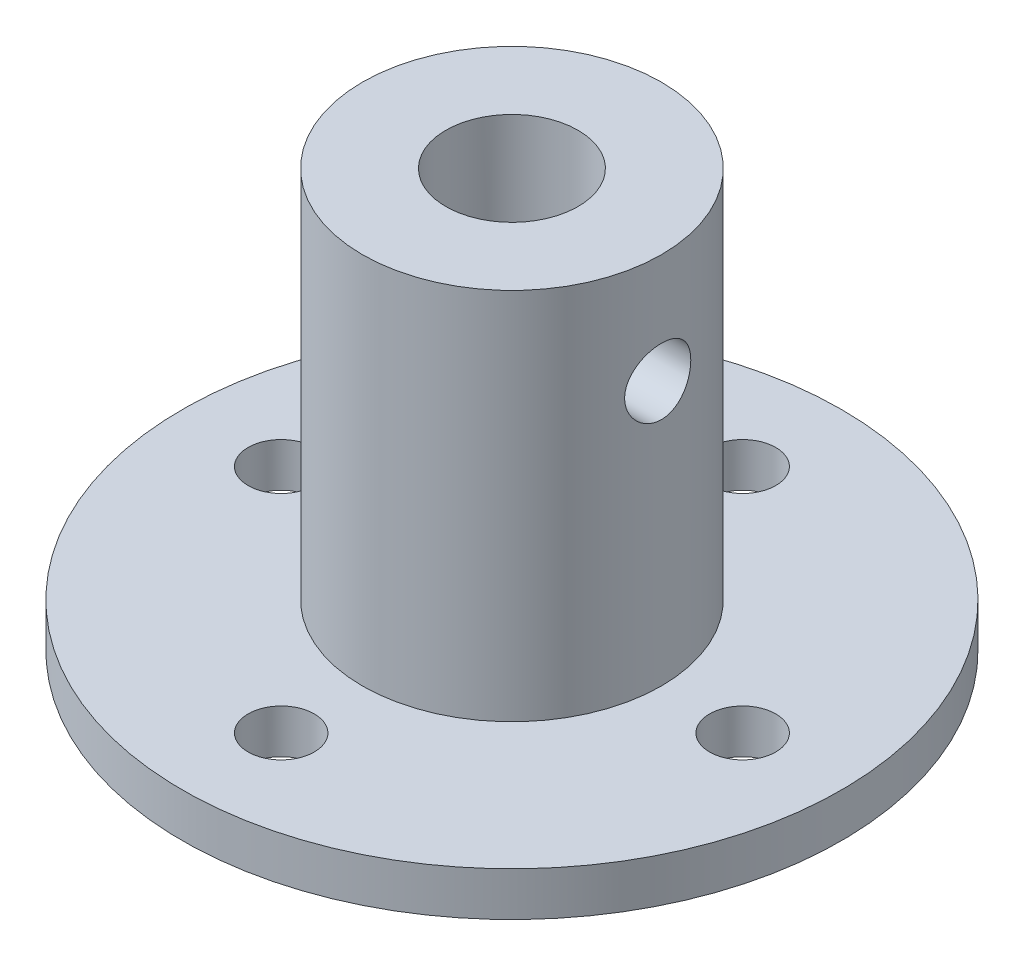
ISO-10303-21;
HEADER;
FILE_DESCRIPTION(('STEP AP214'),'2;1');
FILE_NAME('part.step','',(''),(''),'','','');
FILE_SCHEMA(('AUTOMOTIVE_DESIGN { 1 0 10303 214 1 1 1 1 }'));
ENDSEC;
DATA;
#1=APPLICATION_CONTEXT('core data for automotive mechanical design processes');
#2=APPLICATION_PROTOCOL_DEFINITION('international standard','automotive_design',2000,#1);
#3=PRODUCT_CONTEXT('',#1,'mechanical');
#4=PRODUCT('Part','Part','',(#3));
#5=PRODUCT_RELATED_PRODUCT_CATEGORY('part','',(#4));
#6=PRODUCT_DEFINITION_FORMATION('','',#4);
#7=PRODUCT_DEFINITION_CONTEXT('part definition',#1,'design');
#8=PRODUCT_DEFINITION('design','',#6,#7);
#9=PRODUCT_DEFINITION_SHAPE('','',#8);
#10=(LENGTH_UNIT() NAMED_UNIT(*) SI_UNIT(.MILLI.,.METRE.));
#11=(NAMED_UNIT(*) PLANE_ANGLE_UNIT() SI_UNIT($,.RADIAN.));
#12=(NAMED_UNIT(*) SI_UNIT($,.STERADIAN.) SOLID_ANGLE_UNIT());
#13=UNCERTAINTY_MEASURE_WITH_UNIT(LENGTH_MEASURE(1.E-05),#10,'distance_accuracy_value','');
#14=(GEOMETRIC_REPRESENTATION_CONTEXT(3) GLOBAL_UNCERTAINTY_ASSIGNED_CONTEXT((#13)) GLOBAL_UNIT_ASSIGNED_CONTEXT((#10,
#11,#12)) REPRESENTATION_CONTEXT('',''));
#15=CARTESIAN_POINT('',(0.,0.,0.));
#16=DIRECTION('',(0.,0.,1.));
#17=DIRECTION('',(1.,0.,0.));
#18=AXIS2_PLACEMENT_3D('',#15,#16,#17);
#19=CARTESIAN_POINT('',(0.,1.5875,-21.8080060784619));
#20=DIRECTION('',(0.,1.,0.));
#21=DIRECTION('',(0.,0.,1.));
#22=AXIS2_PLACEMENT_3D('',#19,#20,#21);
#23=PLANE('',#22);
#24=CARTESIAN_POINT('',(8.3312,1.5875,0.));
#25=DIRECTION('',(0.,1.,0.));
#26=DIRECTION('',(0.,0.,1.));
#27=AXIS2_PLACEMENT_3D('',#24,#25,#26);
#28=CIRCLE('',#27,1.1938);
#29=CARTESIAN_POINT('',(8.3312,1.5875,1.1938));
#30=VERTEX_POINT('',#29);
#31=EDGE_CURVE('E123',#30,#30,#28,.F.);
#32=ORIENTED_EDGE('',*,*,#31,.F.);
#33=EDGE_LOOP('',(#32));
#34=FACE_BOUND('',#33,.T.);
#35=CARTESIAN_POINT('',(-8.3312,1.5875,0.));
#36=DIRECTION('',(0.,1.,0.));
#37=DIRECTION('',(0.,0.,1.));
#38=AXIS2_PLACEMENT_3D('',#35,#36,#37);
#39=CIRCLE('',#38,1.1938);
#40=CARTESIAN_POINT('',(-8.3312,1.5875,1.1938));
#41=VERTEX_POINT('',#40);
#42=EDGE_CURVE('E50',#41,#41,#39,.F.);
#43=ORIENTED_EDGE('',*,*,#42,.F.);
#44=EDGE_LOOP('',(#43));
#45=FACE_BOUND('',#44,.T.);
#46=CARTESIAN_POINT('',(0.,1.5875,0.));
#47=DIRECTION('',(0.,-1.,0.));
#48=DIRECTION('',(0.,0.,-1.));
#49=AXIS2_PLACEMENT_3D('',#46,#47,#48);
#50=CIRCLE('',#49,3.9243);
#51=CARTESIAN_POINT('',(0.,1.5875,-3.9243));
#52=VERTEX_POINT('',#51);
#53=EDGE_CURVE('E33',#52,#52,#50,.T.);
#54=ORIENTED_EDGE('',*,*,#53,.F.);
#55=EDGE_LOOP('',(#54));
#56=FACE_BOUND('',#55,.T.);
#57=CARTESIAN_POINT('',(0.,1.5875,0.));
#58=DIRECTION('',(0.,-1.,0.));
#59=DIRECTION('',(0.,0.,-1.));
#60=AXIS2_PLACEMENT_3D('',#57,#58,#59);
#61=CIRCLE('',#60,11.8999);
#62=CARTESIAN_POINT('',(0.,1.5875,-11.8999));
#63=VERTEX_POINT('',#62);
#64=EDGE_CURVE('E38',#63,#63,#61,.T.);
#65=ORIENTED_EDGE('',*,*,#64,.T.);
#66=EDGE_LOOP('',(#65));
#67=FACE_BOUND('',#66,.T.);
#68=CARTESIAN_POINT('',(0.,1.5875,-8.3312));
#69=DIRECTION('',(0.,1.,0.));
#70=DIRECTION('',(0.,0.,1.));
#71=AXIS2_PLACEMENT_3D('',#68,#69,#70);
#72=CIRCLE('',#71,1.1938);
#73=CARTESIAN_POINT('',(0.,1.5875,-7.1374));
#74=VERTEX_POINT('',#73);
#75=EDGE_CURVE('E115',#74,#74,#72,.F.);
#76=ORIENTED_EDGE('',*,*,#75,.F.);
#77=EDGE_LOOP('',(#76));
#78=FACE_BOUND('',#77,.T.);
#79=CARTESIAN_POINT('',(0.,1.5875,8.3312));
#80=DIRECTION('',(0.,1.,0.));
#81=DIRECTION('',(0.,0.,1.));
#82=AXIS2_PLACEMENT_3D('',#79,#80,#81);
#83=CIRCLE('',#82,1.1938);
#84=CARTESIAN_POINT('',(0.,1.5875,9.525));
#85=VERTEX_POINT('',#84);
#86=EDGE_CURVE('E118',#85,#85,#83,.F.);
#87=ORIENTED_EDGE('',*,*,#86,.F.);
#88=EDGE_LOOP('',(#87));
#89=FACE_BOUND('',#88,.T.);
#90=ADVANCED_FACE('F25',(#34,#45,#56,#67,#78,#89),#23,.F.);
#91=CARTESIAN_POINT('',(0.,3.175,-21.8080060784619));
#92=DIRECTION('',(0.,-1.,0.));
#93=DIRECTION('',(0.,0.,-1.));
#94=AXIS2_PLACEMENT_3D('',#91,#92,#93);
#95=PLANE('',#94);
#96=CARTESIAN_POINT('',(8.3312,3.175,0.));
#97=DIRECTION('',(0.,-1.,0.));
#98=DIRECTION('',(0.,0.,-1.));
#99=AXIS2_PLACEMENT_3D('',#96,#97,#98);
#100=CIRCLE('',#99,1.1938);
#101=CARTESIAN_POINT('',(8.3312,3.175,-1.1938));
#102=VERTEX_POINT('',#101);
#103=EDGE_CURVE('E120',#102,#102,#100,.F.);
#104=ORIENTED_EDGE('',*,*,#103,.F.);
#105=EDGE_LOOP('',(#104));
#106=FACE_BOUND('',#105,.T.);
#107=CARTESIAN_POINT('',(-8.3312,3.175,0.));
#108=DIRECTION('',(0.,-1.,0.));
#109=DIRECTION('',(0.,0.,-1.));
#110=AXIS2_PLACEMENT_3D('',#107,#108,#109);
#111=CIRCLE('',#110,1.1938);
#112=CARTESIAN_POINT('',(-8.3312,3.175,-1.1938));
#113=VERTEX_POINT('',#112);
#114=EDGE_CURVE('E128',#113,#113,#111,.F.);
#115=ORIENTED_EDGE('',*,*,#114,.F.);
#116=EDGE_LOOP('',(#115));
#117=FACE_BOUND('',#116,.T.);
#118=CARTESIAN_POINT('',(0.,3.175,0.));
#119=DIRECTION('',(0.,-1.,0.));
#120=DIRECTION('',(0.,0.,-1.));
#121=AXIS2_PLACEMENT_3D('',#118,#119,#120);
#122=CIRCLE('',#121,11.8999);
#123=CARTESIAN_POINT('',(0.,3.175,-11.8999));
#124=VERTEX_POINT('',#123);
#125=EDGE_CURVE('E166',#124,#124,#122,.T.);
#126=ORIENTED_EDGE('',*,*,#125,.F.);
#127=EDGE_LOOP('',(#126));
#128=FACE_BOUND('',#127,.T.);
#129=CARTESIAN_POINT('',(0.,3.175,0.));
#130=DIRECTION('',(0.,-1.,0.));
#131=DIRECTION('',(0.,0.,-1.));
#132=AXIS2_PLACEMENT_3D('',#129,#130,#131);
#133=CIRCLE('',#132,5.3975);
#134=CARTESIAN_POINT('',(0.,3.175,-5.3975));
#135=VERTEX_POINT('',#134);
#136=EDGE_CURVE('E169',#135,#135,#133,.T.);
#137=ORIENTED_EDGE('',*,*,#136,.T.);
#138=EDGE_LOOP('',(#137));
#139=FACE_BOUND('',#138,.T.);
#140=CARTESIAN_POINT('',(0.,3.175,-8.3312));
#141=DIRECTION('',(0.,-1.,0.));
#142=DIRECTION('',(0.,0.,-1.));
#143=AXIS2_PLACEMENT_3D('',#140,#141,#142);
#144=CIRCLE('',#143,1.1938);
#145=CARTESIAN_POINT('',(0.,3.175,-9.525));
#146=VERTEX_POINT('',#145);
#147=EDGE_CURVE('E127',#146,#146,#144,.F.);
#148=ORIENTED_EDGE('',*,*,#147,.F.);
#149=EDGE_LOOP('',(#148));
#150=FACE_BOUND('',#149,.T.);
#151=CARTESIAN_POINT('',(0.,3.175,8.3312));
#152=DIRECTION('',(0.,-1.,0.));
#153=DIRECTION('',(0.,0.,-1.));
#154=AXIS2_PLACEMENT_3D('',#151,#152,#153);
#155=CIRCLE('',#154,1.1938);
#156=CARTESIAN_POINT('',(0.,3.175,7.1374));
#157=VERTEX_POINT('',#156);
#158=EDGE_CURVE('E29',#157,#157,#155,.F.);
#159=ORIENTED_EDGE('',*,*,#158,.F.);
#160=EDGE_LOOP('',(#159));
#161=FACE_BOUND('',#160,.T.);
#162=ADVANCED_FACE('F88',(#106,#117,#128,#139,#150,#161),#95,.F.);
#163=CARTESIAN_POINT('',(0.,0.,-21.8080060784619));
#164=DIRECTION('',(0.,1.,0.));
#165=DIRECTION('',(0.,0.,1.));
#166=AXIS2_PLACEMENT_3D('',#163,#164,#165);
#167=PLANE('',#166);
#168=CARTESIAN_POINT('',(0.,0.,0.));
#169=DIRECTION('',(0.,-1.,0.));
#170=DIRECTION('',(0.,0.,-1.));
#171=AXIS2_PLACEMENT_3D('',#168,#169,#170);
#172=CIRCLE('',#171,2.3876);
#173=CARTESIAN_POINT('',(0.,0.,-2.3876));
#174=VERTEX_POINT('',#173);
#175=EDGE_CURVE('E179',#174,#174,#172,.T.);
#176=ORIENTED_EDGE('',*,*,#175,.F.);
#177=EDGE_LOOP('',(#176));
#178=FACE_BOUND('',#177,.T.);
#179=CARTESIAN_POINT('',(0.,0.,0.));
#180=DIRECTION('',(0.,-1.,0.));
#181=DIRECTION('',(0.,0.,-1.));
#182=AXIS2_PLACEMENT_3D('',#179,#180,#181);
#183=CIRCLE('',#182,3.9243);
#184=CARTESIAN_POINT('',(0.,0.,-3.9243));
#185=VERTEX_POINT('',#184);
#186=EDGE_CURVE('E10',#185,#185,#183,.T.);
#187=ORIENTED_EDGE('',*,*,#186,.T.);
#188=EDGE_LOOP('',(#187));
#189=FACE_BOUND('',#188,.T.);
#190=ADVANCED_FACE('F27',(#178,#189),#167,.F.);
#191=CARTESIAN_POINT('',(0.,0.,0.));
#192=DIRECTION('',(0.,-1.,0.));
#193=DIRECTION('',(0.,0.,-1.));
#194=AXIS2_PLACEMENT_3D('',#191,#192,#193);
#195=CYLINDRICAL_SURFACE('',#194,3.9243);
#196=ORIENTED_EDGE('',*,*,#186,.F.);
#197=EDGE_LOOP('',(#196));
#198=FACE_BOUND('',#197,.T.);
#199=ORIENTED_EDGE('',*,*,#53,.T.);
#200=EDGE_LOOP('',(#199));
#201=FACE_BOUND('',#200,.T.);
#202=ADVANCED_FACE('F95',(#198,#201),#195,.T.);
#203=CARTESIAN_POINT('',(0.,0.,0.));
#204=DIRECTION('',(0.,-1.,0.));
#205=DIRECTION('',(0.,0.,-1.));
#206=AXIS2_PLACEMENT_3D('',#203,#204,#205);
#207=CYLINDRICAL_SURFACE('',#206,11.8999);
#208=ORIENTED_EDGE('',*,*,#64,.F.);
#209=EDGE_LOOP('',(#208));
#210=FACE_BOUND('',#209,.T.);
#211=ORIENTED_EDGE('',*,*,#125,.T.);
#212=EDGE_LOOP('',(#211));
#213=FACE_BOUND('',#212,.T.);
#214=ADVANCED_FACE('F86',(#210,#213),#207,.T.);
#215=CARTESIAN_POINT('',(0.,0.,0.));
#216=DIRECTION('',(0.,-1.,0.));
#217=DIRECTION('',(0.,0.,-1.));
#218=AXIS2_PLACEMENT_3D('',#215,#216,#217);
#219=CYLINDRICAL_SURFACE('',#218,5.3975);
#220=CARTESIAN_POINT('',(-5.26382444711067,12.7,-1.1938));
#221=CARTESIAN_POINT('',(-5.26382578415347,12.7661702685941,-1.19379774984588));
#222=CARTESIAN_POINT('',(-5.26508575545003,12.8323674141414,-1.1882797309663));
#223=CARTESIAN_POINT('',(-5.26997997867348,12.9628778214841,-1.16637841218524));
#224=CARTESIAN_POINT('',(-5.27361592215716,13.0271897069721,-1.14998737118579));
#225=CARTESIAN_POINT('',(-5.28283061311481,13.1520228509558,-1.10688248680728));
#226=CARTESIAN_POINT('',(-5.2884072006729,13.2125482357961,-1.08018011621852));
#227=CARTESIAN_POINT('',(-5.30087223338352,13.328261867473,-1.01724355777763));
#228=CARTESIAN_POINT('',(-5.30776065774752,13.3834501988645,-0.981009520969179));
#229=CARTESIAN_POINT('',(-5.32220613392169,13.4878769294094,-0.899371098034646));
#230=CARTESIAN_POINT('',(-5.32977190142588,13.5370097292132,-0.8538331544698));
#231=CARTESIAN_POINT('',(-5.34464334205277,13.6270054491259,-0.755167843248626));
#232=CARTESIAN_POINT('',(-5.35194899463663,13.6678677173761,-0.702039877931926));
#233=CARTESIAN_POINT('',(-5.36557208684666,13.740581218177,-0.588993479205267));
#234=CARTESIAN_POINT('',(-5.37187804298682,13.7723307223337,-0.529008109283108));
#235=CARTESIAN_POINT('',(-5.38269270912959,13.8252590529265,-0.404390487241094));
#236=CARTESIAN_POINT('',(-5.38720162541889,13.8464390927282,-0.339758769493096));
#237=CARTESIAN_POINT('',(-5.3938525870581,13.8772946916617,-0.208781328778443));
#238=CARTESIAN_POINT('',(-5.39603137251229,13.8871490195043,-0.142479617233934));
#239=CARTESIAN_POINT('',(-5.39790393023066,13.895632565009,-0.00913067513711657));
#240=CARTESIAN_POINT('',(-5.39759799292244,13.894263094568,0.057916467370424));
#241=CARTESIAN_POINT('',(-5.39456360089335,13.8804707243369,0.189620119857848));
#242=CARTESIAN_POINT('',(-5.39187738295879,13.8682405339713,0.254297927469926));
#243=CARTESIAN_POINT('',(-5.38443245616669,13.8333811786812,0.380659749790105));
#244=CARTESIAN_POINT('',(-5.37967365222839,13.8107515366748,0.442343627006063));
#245=CARTESIAN_POINT('',(-5.36855057930608,13.7555662803426,0.561499548515559));
#246=CARTESIAN_POINT('',(-5.36217461019906,13.7229379514426,0.618936779227974));
#247=CARTESIAN_POINT('',(-5.34851578071422,13.6487358066008,0.727590737089718));
#248=CARTESIAN_POINT('',(-5.34123279425877,13.6071607464552,0.778806597494365));
#249=CARTESIAN_POINT('',(-5.32637742354258,13.5151972982437,0.87471039835053));
#250=CARTESIAN_POINT('',(-5.31880217870766,13.4646402597448,0.9192363191774));
#251=CARTESIAN_POINT('',(-5.30436094157517,13.3566983480059,0.999208447324352));
#252=CARTESIAN_POINT('',(-5.29749496939257,13.2993132812222,1.03465439717848));
#253=CARTESIAN_POINT('',(-5.28524189323355,13.1790782350536,1.09553468711881));
#254=CARTESIAN_POINT('',(-5.27985941819434,13.1162119382469,1.12093779540818));
#255=CARTESIAN_POINT('',(-5.27124647395836,12.9869553942399,1.16076978074624));
#256=CARTESIAN_POINT('',(-5.26801565487397,12.9205657218837,1.17520044211354));
#257=CARTESIAN_POINT('',(-5.26414334960272,12.7876290680902,1.19242531072601));
#258=CARTESIAN_POINT('',(-5.26344931699878,12.7211141839457,1.19545569988305));
#259=CARTESIAN_POINT('',(-5.26458732330362,12.5885296153253,1.19043397004535));
#260=CARTESIAN_POINT('',(-5.26641918444991,12.5224598998489,1.18238263093924));
#261=CARTESIAN_POINT('',(-5.27235289802696,12.3934675071958,1.15563107848453));
#262=CARTESIAN_POINT('',(-5.27642688785295,12.3305163390316,1.13706149274304));
#263=CARTESIAN_POINT('',(-5.2863605903461,12.2086189415852,1.08994225559975));
#264=CARTESIAN_POINT('',(-5.29222047708606,12.149673103391,1.06139163129826));
#265=CARTESIAN_POINT('',(-5.30518080244967,12.0364391143524,0.994602353773198));
#266=CARTESIAN_POINT('',(-5.31229928674315,11.982238701375,0.956218524361973));
#267=CARTESIAN_POINT('',(-5.32692739394632,11.8809616620235,0.87104189418985));
#268=CARTESIAN_POINT('',(-5.33443706649221,11.8338859426455,0.824248024460122));
#269=CARTESIAN_POINT('',(-5.34917497399701,11.7472749207666,0.722509719120593));
#270=CARTESIAN_POINT('',(-5.35639509359001,11.7079008189224,0.667426675166462));
#271=CARTESIAN_POINT('',(-5.36958980353617,11.6389648036399,0.55129108882186));
#272=CARTESIAN_POINT('',(-5.37556445273891,11.6094024265496,0.490238828682533));
#273=CARTESIAN_POINT('',(-5.38556088659178,11.5611520564143,0.364282469944756));
#274=CARTESIAN_POINT('',(-5.38959516936264,11.5423943104059,0.299406128860069));
#275=CARTESIAN_POINT('',(-5.39531040949971,11.5160683519074,0.167323618069814));
#276=CARTESIAN_POINT('',(-5.39699171710073,11.5084984741202,0.10011779662831));
#277=CARTESIAN_POINT('',(-5.39780088062668,11.504839416257,-0.0331868714888969));
#278=CARTESIAN_POINT('',(-5.39698221905978,11.5085097756106,-0.0992789072242101));
#279=CARTESIAN_POINT('',(-5.39299831354787,11.5266881916768,-0.229879270685647));
#280=CARTESIAN_POINT('',(-5.38983311364613,11.5411960449754,-0.294387628113086));
#281=CARTESIAN_POINT('',(-5.38151606202691,11.5805213018768,-0.419798590757465));
#282=CARTESIAN_POINT('',(-5.37637092218423,11.6053038964672,-0.48071258459367));
#283=CARTESIAN_POINT('',(-5.36464281096966,11.664441476956,-0.597549436520733));
#284=CARTESIAN_POINT('',(-5.35805969667744,11.698797414443,-0.653471797714204));
#285=CARTESIAN_POINT('',(-5.34401403622104,11.7768867737438,-0.759908553552908));
#286=CARTESIAN_POINT('',(-5.33653693136061,11.8207888707088,-0.810297285973092));
#287=CARTESIAN_POINT('',(-5.3216234124524,11.9163850193007,-0.903074561644765));
#288=CARTESIAN_POINT('',(-5.31418700867946,11.9680809522167,-0.945461167750838));
#289=CARTESIAN_POINT('',(-5.30008278439156,12.0786517226949,-1.02159301434042));
#290=CARTESIAN_POINT('',(-5.29342692905017,12.1376154444118,-1.05521151093274));
#291=CARTESIAN_POINT('',(-5.28178853264086,12.2604909420044,-1.1120085881044));
#292=CARTESIAN_POINT('',(-5.27680459054452,12.3243985194823,-1.13519591537155));
#293=CARTESIAN_POINT('',(-5.26998548571928,12.4402994262764,-1.16638257437939));
#294=CARTESIAN_POINT('',(-5.26769057534933,12.4916689378175,-1.17664420182981));
#295=CARTESIAN_POINT('',(-5.26460956577482,12.5953533949017,-1.19035363082945));
#296=CARTESIAN_POINT('',(-5.26382338969116,12.6476682921345,-1.19380177956672));
#297=CARTESIAN_POINT('',(-5.26382444711067,12.7,-1.1938));
#298=B_SPLINE_CURVE_WITH_KNOTS('',3,(#220,#221,#222,#223,#224,#225,#226,#227,#228,#229,#230,
#231,#232,#233,#234,#235,#236,#237,#238,#239,#240,#241,#242,#243,#244,#245,#246,#247,#248,#249,
#250,#251,#252,#253,#254,#255,#256,#257,#258,#259,#260,#261,#262,#263,#264,#265,#266,#267,#268,
#269,#270,#271,#272,#273,#274,#275,#276,#277,#278,#279,#280,#281,#282,#283,#284,#285,#286,#287,
#288,#289,#290,#291,#292,#293,#294,#295,#296,#297),.UNSPECIFIED.,.T.,.F.,(4,2,2,2,2,2,2,2,2,2,2,
2,2,2,2,2,2,2,2,2,2,2,2,2,2,2,2,2,2,2,2,2,2,2,2,2,2,2,4),(0.,0.198318987053293,
0.396779319976053,0.595019471430783,0.793256481659141,0.994569177374323,1.19589773378243,
1.39939337351754,1.60286564674728,1.80308012505208,2.00327120156167,2.19997958211363,
2.39669698769732,2.59488039097799,2.7930913730513,2.9955183038815,3.19795097396737,
3.40100831967772,3.60403263751931,3.8028269308147,4.00160723446165,4.1979713451246,
4.39435460167822,4.5938235678414,4.7933179057142,4.99662269227714,5.19991787032853,
5.40188545717413,5.60382297842302,5.80147088332305,5.99911507857167,6.19609509179323,
6.39309469178263,6.5939083017002,6.79477046218211,6.99839266255881,7.20184380303858,
7.35869521677338,7.51553863777134),.UNSPECIFIED.);
#299=CARTESIAN_POINT('',(-5.26382444711067,12.7,-1.1938));
#300=VERTEX_POINT('',#299);
#301=EDGE_CURVE('E76',#300,#300,#298,.T.);
#302=ORIENTED_EDGE('',*,*,#301,.T.);
#303=EDGE_LOOP('',(#302));
#304=FACE_BOUND('',#303,.T.);
#305=CARTESIAN_POINT('',(5.26382444711067,12.7,-1.1938));
#306=CARTESIAN_POINT('',(5.26382578415347,12.6338297314059,-1.19379774984588));
#307=CARTESIAN_POINT('',(5.26508575545003,12.5676325858586,-1.1882797309663));
#308=CARTESIAN_POINT('',(5.26997997867348,12.4371221785159,-1.16637841218524));
#309=CARTESIAN_POINT('',(5.27361592215716,12.3728102930279,-1.14998737118579));
#310=CARTESIAN_POINT('',(5.28283061311481,12.2479771490442,-1.10688248680728));
#311=CARTESIAN_POINT('',(5.2884072006729,12.1874517642039,-1.08018011621852));
#312=CARTESIAN_POINT('',(5.30087223338352,12.071738132527,-1.01724355777763));
#313=CARTESIAN_POINT('',(5.30776065774752,12.0165498011355,-0.981009520969178));
#314=CARTESIAN_POINT('',(5.32220613392169,11.9121230705906,-0.899371098034646));
#315=CARTESIAN_POINT('',(5.32977190142588,11.8629902707868,-0.8538331544698));
#316=CARTESIAN_POINT('',(5.34464334205277,11.7729945508741,-0.755167843248626));
#317=CARTESIAN_POINT('',(5.35194899463663,11.7321322826239,-0.702039877931926));
#318=CARTESIAN_POINT('',(5.36557208684666,11.659418781823,-0.588993479205267));
#319=CARTESIAN_POINT('',(5.37187804298682,11.6276692776663,-0.529008109283107));
#320=CARTESIAN_POINT('',(5.38269270912959,11.5747409470735,-0.404390487241093));
#321=CARTESIAN_POINT('',(5.38720162541889,11.5535609072718,-0.339758769493095));
#322=CARTESIAN_POINT('',(5.3938525870581,11.5227053083383,-0.208781328778443));
#323=CARTESIAN_POINT('',(5.39603137251229,11.5128509804957,-0.142479617233934));
#324=CARTESIAN_POINT('',(5.39790393023066,11.504367434991,-0.0091306751371166));
#325=CARTESIAN_POINT('',(5.39759799292244,11.505736905432,0.057916467370424));
#326=CARTESIAN_POINT('',(5.39456360089335,11.5195292756631,0.189620119857848));
#327=CARTESIAN_POINT('',(5.39187738295879,11.5317594660287,0.254297927469926));
#328=CARTESIAN_POINT('',(5.38443245616669,11.5666188213188,0.380659749790105));
#329=CARTESIAN_POINT('',(5.37967365222839,11.5892484633252,0.442343627006063));
#330=CARTESIAN_POINT('',(5.36855057930608,11.6444337196574,0.561499548515559));
#331=CARTESIAN_POINT('',(5.36217461019906,11.6770620485574,0.618936779227974));
#332=CARTESIAN_POINT('',(5.34851578071422,11.7512641933992,0.727590737089719));
#333=CARTESIAN_POINT('',(5.34123279425877,11.7928392535448,0.778806597494365));
#334=CARTESIAN_POINT('',(5.32637742354258,11.8848027017563,0.874710398350531));
#335=CARTESIAN_POINT('',(5.31880217870766,11.9353597402552,0.9192363191774));
#336=CARTESIAN_POINT('',(5.30436094157517,12.0433016519941,0.999208447324352));
#337=CARTESIAN_POINT('',(5.29749496939257,12.1006867187778,1.03465439717848));
#338=CARTESIAN_POINT('',(5.28524189323355,12.2209217649464,1.09553468711881));
#339=CARTESIAN_POINT('',(5.27985941819434,12.2837880617531,1.12093779540818));
#340=CARTESIAN_POINT('',(5.27124647395836,12.4130446057601,1.16076978074624));
#341=CARTESIAN_POINT('',(5.26801565487397,12.4794342781163,1.17520044211354));
#342=CARTESIAN_POINT('',(5.26414334960272,12.6123709319098,1.19242531072601));
#343=CARTESIAN_POINT('',(5.26344931699878,12.6788858160543,1.19545569988305));
#344=CARTESIAN_POINT('',(5.26458732330362,12.8114703846747,1.19043397004535));
#345=CARTESIAN_POINT('',(5.26641918444991,12.8775401001511,1.18238263093924));
#346=CARTESIAN_POINT('',(5.27235289802696,13.0065324928042,1.15563107848453));
#347=CARTESIAN_POINT('',(5.27642688785295,13.0694836609684,1.13706149274304));
#348=CARTESIAN_POINT('',(5.2863605903461,13.1913810584148,1.08994225559975));
#349=CARTESIAN_POINT('',(5.29222047708606,13.250326896609,1.06139163129826));
#350=CARTESIAN_POINT('',(5.30518080244967,13.3635608856476,0.994602353773198));
#351=CARTESIAN_POINT('',(5.31229928674315,13.417761298625,0.956218524361973));
#352=CARTESIAN_POINT('',(5.32692739394632,13.5190383379765,0.87104189418985));
#353=CARTESIAN_POINT('',(5.33443706649221,13.5661140573545,0.824248024460122));
#354=CARTESIAN_POINT('',(5.34917497399701,13.6527250792334,0.722509719120593));
#355=CARTESIAN_POINT('',(5.35639509359001,13.6920991810776,0.667426675166462));
#356=CARTESIAN_POINT('',(5.36958980353617,13.7610351963601,0.55129108882186));
#357=CARTESIAN_POINT('',(5.37556445273891,13.7905975734504,0.490238828682533));
#358=CARTESIAN_POINT('',(5.38556088659178,13.8388479435857,0.364282469944756));
#359=CARTESIAN_POINT('',(5.38959516936264,13.8576056895941,0.299406128860069));
#360=CARTESIAN_POINT('',(5.39531040949971,13.8839316480926,0.167323618069814));
#361=CARTESIAN_POINT('',(5.39699171710073,13.8915015258798,0.10011779662831));
#362=CARTESIAN_POINT('',(5.39780088062668,13.895160583743,-0.0331868714888969));
#363=CARTESIAN_POINT('',(5.39698221905978,13.8914902243894,-0.0992789072242101));
#364=CARTESIAN_POINT('',(5.39299831354787,13.8733118083232,-0.229879270685647));
#365=CARTESIAN_POINT('',(5.38983311364613,13.8588039550246,-0.294387628113086));
#366=CARTESIAN_POINT('',(5.38151606202691,13.8194786981232,-0.419798590757465));
#367=CARTESIAN_POINT('',(5.37637092218423,13.7946961035328,-0.48071258459367));
#368=CARTESIAN_POINT('',(5.36464281096966,13.7355585230441,-0.597549436520733));
#369=CARTESIAN_POINT('',(5.35805969667744,13.701202585557,-0.653471797714204));
#370=CARTESIAN_POINT('',(5.34401403622104,13.6231132262562,-0.759908553552908));
#371=CARTESIAN_POINT('',(5.33653693136061,13.5792111292912,-0.810297285973092));
#372=CARTESIAN_POINT('',(5.3216234124524,13.4836149806993,-0.903074561644765));
#373=CARTESIAN_POINT('',(5.31418700867946,13.4319190477832,-0.945461167750838));
#374=CARTESIAN_POINT('',(5.30008278439156,13.3213482773051,-1.02159301434042));
#375=CARTESIAN_POINT('',(5.29342692905017,13.2623845555882,-1.05521151093274));
#376=CARTESIAN_POINT('',(5.28178853264086,13.1395090579956,-1.1120085881044));
#377=CARTESIAN_POINT('',(5.27680459054452,13.0756014805177,-1.13519591537155));
#378=CARTESIAN_POINT('',(5.26998548571928,12.9597005737236,-1.16638257437939));
#379=CARTESIAN_POINT('',(5.26769057534933,12.9083310621825,-1.17664420182981));
#380=CARTESIAN_POINT('',(5.26460956577482,12.8046466050983,-1.19035363082945));
#381=CARTESIAN_POINT('',(5.26382338969116,12.7523317078655,-1.19380177956672));
#382=CARTESIAN_POINT('',(5.26382444711067,12.7,-1.1938));
#383=B_SPLINE_CURVE_WITH_KNOTS('',3,(#305,#306,#307,#308,#309,#310,#311,#312,#313,#314,#315,
#316,#317,#318,#319,#320,#321,#322,#323,#324,#325,#326,#327,#328,#329,#330,#331,#332,#333,#334,
#335,#336,#337,#338,#339,#340,#341,#342,#343,#344,#345,#346,#347,#348,#349,#350,#351,#352,#353,
#354,#355,#356,#357,#358,#359,#360,#361,#362,#363,#364,#365,#366,#367,#368,#369,#370,#371,#372,
#373,#374,#375,#376,#377,#378,#379,#380,#381,#382),.UNSPECIFIED.,.T.,.F.,(4,2,2,2,2,2,2,2,2,2,2,
2,2,2,2,2,2,2,2,2,2,2,2,2,2,2,2,2,2,2,2,2,2,2,2,2,2,2,4),(0.,0.198318987053293,
0.396779319976053,0.595019471430787,0.793256481659141,0.994569177374323,1.19589773378243,
1.39939337351754,1.60286564674728,1.80308012505208,2.00327120156167,2.19997958211363,
2.39669698769732,2.59488039097799,2.7930913730513,2.9955183038815,3.19795097396737,
3.40100831967772,3.60403263751931,3.8028269308147,4.00160723446165,4.1979713451246,
4.39435460167822,4.5938235678414,4.7933179057142,4.99662269227714,5.19991787032853,
5.40188545717413,5.60382297842302,5.80147088332305,5.99911507857167,6.19609509179323,
6.39309469178263,6.5939083017002,6.79477046218211,6.99839266255881,7.20184380303858,
7.35869521677338,7.51553863777134),.UNSPECIFIED.);
#384=CARTESIAN_POINT('',(5.26382444711067,12.7,-1.1938));
#385=VERTEX_POINT('',#384);
#386=EDGE_CURVE('E70',#385,#385,#383,.T.);
#387=ORIENTED_EDGE('',*,*,#386,.T.);
#388=EDGE_LOOP('',(#387));
#389=FACE_BOUND('',#388,.T.);
#390=ORIENTED_EDGE('',*,*,#136,.F.);
#391=EDGE_LOOP('',(#390));
#392=FACE_BOUND('',#391,.T.);
#393=CARTESIAN_POINT('',(0.,16.6624,0.));
#394=DIRECTION('',(0.,-1.,0.));
#395=DIRECTION('',(0.,0.,-1.));
#396=AXIS2_PLACEMENT_3D('',#393,#394,#395);
#397=CIRCLE('',#396,5.3975);
#398=CARTESIAN_POINT('',(0.,16.6624,-5.3975));
#399=VERTEX_POINT('',#398);
#400=EDGE_CURVE('E171',#399,#399,#397,.T.);
#401=ORIENTED_EDGE('',*,*,#400,.T.);
#402=EDGE_LOOP('',(#401));
#403=FACE_BOUND('',#402,.T.);
#404=ADVANCED_FACE('F81',(#304,#389,#392,#403),#219,.T.);
#405=CARTESIAN_POINT('',(0.,16.6624,-21.8080060784619));
#406=DIRECTION('',(0.,-1.,0.));
#407=DIRECTION('',(0.,0.,-1.));
#408=AXIS2_PLACEMENT_3D('',#405,#406,#407);
#409=PLANE('',#408);
#410=ORIENTED_EDGE('',*,*,#400,.F.);
#411=EDGE_LOOP('',(#410));
#412=FACE_BOUND('',#411,.T.);
#413=CARTESIAN_POINT('',(0.,16.6624,0.));
#414=DIRECTION('',(0.,-1.,0.));
#415=DIRECTION('',(0.,0.,-1.));
#416=AXIS2_PLACEMENT_3D('',#413,#414,#415);
#417=CIRCLE('',#416,2.3876);
#418=CARTESIAN_POINT('',(0.,16.6624,-2.3876));
#419=VERTEX_POINT('',#418);
#420=EDGE_CURVE('E175',#419,#419,#417,.T.);
#421=ORIENTED_EDGE('',*,*,#420,.T.);
#422=EDGE_LOOP('',(#421));
#423=FACE_BOUND('',#422,.T.);
#424=ADVANCED_FACE('F85',(#412,#423),#409,.F.);
#425=CARTESIAN_POINT('',(0.,0.,0.));
#426=DIRECTION('',(0.,-1.,0.));
#427=DIRECTION('',(0.,0.,-1.));
#428=AXIS2_PLACEMENT_3D('',#425,#426,#427);
#429=CYLINDRICAL_SURFACE('',#428,2.3876);
#430=CARTESIAN_POINT('',(-2.06772225407573,12.7,-1.1938));
#431=CARTESIAN_POINT('',(-2.06772767358835,12.6377936985765,-1.19379565823838));
#432=CARTESIAN_POINT('',(-2.07057209857944,12.5755088509214,-1.18890538506131));
#433=CARTESIAN_POINT('',(-2.0815379307046,12.4528508514284,-1.1695935679763));
#434=CARTESIAN_POINT('',(-2.08967042583527,12.3924819966212,-1.15515199586478));
#435=CARTESIAN_POINT('',(-2.11003369977525,12.2756618031062,-1.11751611875784));
#436=CARTESIAN_POINT('',(-2.12224265498368,12.219191495877,-1.09436834128702));
#437=CARTESIAN_POINT('',(-2.14934933258365,12.1109501876563,-1.04011917179431));
#438=CARTESIAN_POINT('',(-2.16424720042126,12.0591794410967,-1.00901734949191));
#439=CARTESIAN_POINT('',(-2.19655462280774,11.957091421248,-0.936734916085764));
#440=CARTESIAN_POINT('',(-2.21406999170989,11.9072462038329,-0.894934600748433));
#441=CARTESIAN_POINT('',(-2.24878473049575,11.8149066659201,-0.803730395530152));
#442=CARTESIAN_POINT('',(-2.26598393895746,11.7724160121078,-0.754322735998901));
#443=CARTESIAN_POINT('',(-2.29951519186431,11.6931882949599,-0.645236440804285));
#444=CARTESIAN_POINT('',(-2.31571063442014,11.6570321319293,-0.585089962243212));
#445=CARTESIAN_POINT('',(-2.34403532631618,11.5955668493952,-0.458606658354489));
#446=CARTESIAN_POINT('',(-2.35616714075151,11.5702508843834,-0.392273772029331));
#447=CARTESIAN_POINT('',(-2.37423494633371,11.5330549353387,-0.260302054058833));
#448=CARTESIAN_POINT('',(-2.38055037487701,11.5203470954368,-0.194949677485552));
#449=CARTESIAN_POINT('',(-2.38769053595435,11.5060016875257,-0.0627588165394923));
#450=CARTESIAN_POINT('',(-2.38851859071443,11.5043574212773,0.0040787440562539));
#451=CARTESIAN_POINT('',(-2.38477047811858,11.5118665793858,0.131118067657072));
#452=CARTESIAN_POINT('',(-2.38065800396061,11.5200934629292,0.191391447577252));
#453=CARTESIAN_POINT('',(-2.36819173991086,11.5454531514534,0.309568780916092));
#454=CARTESIAN_POINT('',(-2.35983763264461,11.5625866228598,0.367472556681927));
#455=CARTESIAN_POINT('',(-2.33950876128802,11.605383967398,0.480276951655732));
#456=CARTESIAN_POINT('',(-2.32748550297558,11.6311625826648,0.535124936992419));
#457=CARTESIAN_POINT('',(-2.30090201778907,11.6903596662613,0.639849105646611));
#458=CARTESIAN_POINT('',(-2.28634088308805,11.7237808697703,0.689723499783575));
#459=CARTESIAN_POINT('',(-2.254424380338,11.8009436706601,0.788115316380264));
#460=CARTESIAN_POINT('',(-2.23693499066621,11.8453621952156,0.83605881877005));
#461=CARTESIAN_POINT('',(-2.20201591792536,11.9414472136216,0.924125797261489));
#462=CARTESIAN_POINT('',(-2.18458629083508,11.9931192318208,0.964243256777316));
#463=CARTESIAN_POINT('',(-2.15056093543208,12.1062614121159,1.03801546849587));
#464=CARTESIAN_POINT('',(-2.13408845204907,12.1681454143221,1.0710980306208));
#465=CARTESIAN_POINT('',(-2.10557012542564,12.2976149920684,1.12613435710087));
#466=CARTESIAN_POINT('',(-2.09351966668995,12.3651945317364,1.14809973417216));
#467=CARTESIAN_POINT('',(-2.07655106238376,12.4985038835694,1.17849573592169));
#468=CARTESIAN_POINT('',(-2.07114338751935,12.5639558879142,1.18786099078683));
#469=CARTESIAN_POINT('',(-2.06668172133889,12.6957039215024,1.19561093086472));
#470=CARTESIAN_POINT('',(-2.0676232418846,12.7619993214832,1.19400337256268));
#471=CARTESIAN_POINT('',(-2.0752343096215,12.8858196479993,1.18071122854403));
#472=CARTESIAN_POINT('',(-2.08126599565444,12.9435106687326,1.17014821559134));
#473=CARTESIAN_POINT('',(-2.09743522927991,13.0561914632503,1.14091022459421));
#474=CARTESIAN_POINT('',(-2.10757410646809,13.1111803558213,1.12223261952087));
#475=CARTESIAN_POINT('',(-2.13136541918694,13.2197940468316,1.07638689127651));
#476=CARTESIAN_POINT('',(-2.14515883703569,13.2732377103198,1.04886559323637));
#477=CARTESIAN_POINT('',(-2.17457975455817,13.3750572163632,0.986421497022067));
#478=CARTESIAN_POINT('',(-2.19020819455375,13.4234304364262,0.9514948966918));
#479=CARTESIAN_POINT('',(-2.22390612557174,13.5201152526696,0.870085810201992));
#480=CARTESIAN_POINT('',(-2.2420349896959,13.5676504385267,0.822701626089607));
#481=CARTESIAN_POINT('',(-2.27698529716608,13.6543383297167,0.720344286606477));
#482=CARTESIAN_POINT('',(-2.29380629766203,13.6934882035412,0.665368578043554));
#483=CARTESIAN_POINT('',(-2.32482237586664,13.7631669140392,0.547399515822645));
#484=CARTESIAN_POINT('',(-2.33893643428069,13.7934409565202,0.484232853883977));
#485=CARTESIAN_POINT('',(-2.36233149150414,13.842631229625,0.352794598908524));
#486=CARTESIAN_POINT('',(-2.37161673320854,13.8615574334011,0.28452754792198));
#487=CARTESIAN_POINT('',(-2.38363071267532,13.8858833919117,0.151588344766053));
#488=CARTESIAN_POINT('',(-2.38688285936799,13.8923649042209,0.0871610616686765));
#489=CARTESIAN_POINT('',(-2.38810295241832,13.8948066902995,-0.0419334020285457));
#490=CARTESIAN_POINT('',(-2.38607274858253,13.8907706471714,-0.106600490732273));
#491=CARTESIAN_POINT('',(-2.37726131998712,13.8730082935674,-0.229851855228209));
#492=CARTESIAN_POINT('',(-2.37080197654646,13.8599380429562,-0.288556165003086));
#493=CARTESIAN_POINT('',(-2.35407921415395,13.8253630282321,-0.402842977716802));
#494=CARTESIAN_POINT('',(-2.34381524968331,13.8038570545524,-0.458425031659885));
#495=CARTESIAN_POINT('',(-2.31986296127106,13.7520636451243,-0.567560462375143));
#496=CARTESIAN_POINT('',(-2.30604695211926,13.7214399639545,-0.620925395355315));
#497=CARTESIAN_POINT('',(-2.27643493344712,13.6527026221405,-0.721979967397583));
#498=CARTESIAN_POINT('',(-2.26063801573371,13.6145855213857,-0.769666983611916));
#499=CARTESIAN_POINT('',(-2.22677854888548,13.5275455754347,-0.863014738162497));
#500=CARTESIAN_POINT('',(-2.20864698060165,13.4779248624497,-0.908001515802984));
#501=CARTESIAN_POINT('',(-2.17346900323213,13.3715713291153,-0.989258232491765));
#502=CARTESIAN_POINT('',(-2.15642356390515,13.3148322836482,-1.02552045976201));
#503=CARTESIAN_POINT('',(-2.12495928813009,13.1934731713117,-1.08926022304811));
#504=CARTESIAN_POINT('',(-2.11064048027135,13.1286607133385,-1.11642393174417));
#505=CARTESIAN_POINT('',(-2.08755217424786,12.9944717756992,-1.15903500340875));
#506=CARTESIAN_POINT('',(-2.07876413277127,12.925111417216,-1.17452155202513));
#507=CARTESIAN_POINT('',(-2.07159245632018,12.8291627664226,-1.18707533398854));
#508=CARTESIAN_POINT('',(-2.0701462440635,12.8034214076678,-1.18959317410584));
#509=CARTESIAN_POINT('',(-2.06820998262796,12.7517912453615,-1.1929564669964));
#510=CARTESIAN_POINT('',(-2.06771999741435,12.7259024320625,-1.19380180789057));
#511=CARTESIAN_POINT('',(-2.06772225407573,12.7,-1.1938));
#512=B_SPLINE_CURVE_WITH_KNOTS('',3,(#430,#431,#432,#433,#434,#435,#436,#437,#438,#439,#440,
#441,#442,#443,#444,#445,#446,#447,#448,#449,#450,#451,#452,#453,#454,#455,#456,#457,#458,#459,
#460,#461,#462,#463,#464,#465,#466,#467,#468,#469,#470,#471,#472,#473,#474,#475,#476,#477,#478,
#479,#480,#481,#482,#483,#484,#485,#486,#487,#488,#489,#490,#491,#492,#493,#494,#495,#496,#497,
#498,#499,#500,#501,#502,#503,#504,#505,#506,#507,#508,#509,#510,#511),.UNSPECIFIED.,.T.,.F.,(4,
2,2,2,2,2,2,2,2,2,2,2,2,2,2,2,2,2,2,2,2,2,2,2,2,2,2,2,2,2,2,2,2,2,2,2,2,2,2,2,4),(0.,
0.186509907953573,0.373412155454251,0.559329437807967,0.745256779636419,0.946519028660391,
1.14788133160522,1.36281691754636,1.57761657229493,1.77713228354721,1.97652719076395,
2.15858257177042,2.34065157683338,2.52523958562043,2.70989375964355,2.91200281161236,
3.11426663595977,3.32937499256615,3.54425818653933,3.74211282821758,3.9398276244828,
4.11591420171601,4.29205782798172,4.47635958449587,4.66075619849492,4.86839690486536,
5.07610761610978,5.28930019770798,5.50230513735711,5.69576628390969,5.88915969214643,
6.06980954411588,6.25048530826641,6.43888864208906,6.62737867174238,6.83462726720611,
7.04205838568545,7.25604472202286,7.46930973778695,7.54696645384222,7.62462836443983),.UNSPECIFIED.);
#513=CARTESIAN_POINT('',(-2.06772225407573,12.7,-1.1938));
#514=VERTEX_POINT('',#513);
#515=EDGE_CURVE('E49',#514,#514,#512,.T.);
#516=ORIENTED_EDGE('',*,*,#515,.T.);
#517=EDGE_LOOP('',(#516));
#518=FACE_BOUND('',#517,.T.);
#519=CARTESIAN_POINT('',(2.06772225407573,12.7,-1.1938));
#520=CARTESIAN_POINT('',(2.06772767358835,12.7622063014235,-1.19379565823838));
#521=CARTESIAN_POINT('',(2.07057209857944,12.8244911490786,-1.18890538506131));
#522=CARTESIAN_POINT('',(2.0815379307046,12.9471491485716,-1.1695935679763));
#523=CARTESIAN_POINT('',(2.08967042583527,13.0075180033788,-1.15515199586478));
#524=CARTESIAN_POINT('',(2.11003369977525,13.1243381968938,-1.11751611875784));
#525=CARTESIAN_POINT('',(2.12224265498368,13.180808504123,-1.09436834128702));
#526=CARTESIAN_POINT('',(2.14934933258365,13.2890498123437,-1.04011917179431));
#527=CARTESIAN_POINT('',(2.16424720042126,13.3408205589033,-1.00901734949191));
#528=CARTESIAN_POINT('',(2.19655462280774,13.4429085787519,-0.936734916085764));
#529=CARTESIAN_POINT('',(2.21406999170989,13.4927537961671,-0.894934600748433));
#530=CARTESIAN_POINT('',(2.24878473049575,13.5850933340799,-0.803730395530152));
#531=CARTESIAN_POINT('',(2.26598393895746,13.6275839878922,-0.754322735998901));
#532=CARTESIAN_POINT('',(2.29951519186431,13.7068117050401,-0.645236440804285));
#533=CARTESIAN_POINT('',(2.31571063442014,13.7429678680707,-0.585089962243212));
#534=CARTESIAN_POINT('',(2.34403532631618,13.8044331506048,-0.458606658354489));
#535=CARTESIAN_POINT('',(2.35616714075151,13.8297491156166,-0.392273772029331));
#536=CARTESIAN_POINT('',(2.37423494633371,13.8669450646612,-0.260302054058833));
#537=CARTESIAN_POINT('',(2.38055037487701,13.8796529045632,-0.194949677485552));
#538=CARTESIAN_POINT('',(2.38769053595435,13.8939983124743,-0.0627588165394923));
#539=CARTESIAN_POINT('',(2.38851859071443,13.8956425787227,0.0040787440562539));
#540=CARTESIAN_POINT('',(2.38477047811858,13.8881334206142,0.131118067657072));
#541=CARTESIAN_POINT('',(2.38065800396061,13.8799065370708,0.191391447577252));
#542=CARTESIAN_POINT('',(2.36819173991086,13.8545468485466,0.309568780916092));
#543=CARTESIAN_POINT('',(2.35983763264461,13.8374133771402,0.367472556681927));
#544=CARTESIAN_POINT('',(2.33950876128802,13.794616032602,0.480276951655732));
#545=CARTESIAN_POINT('',(2.32748550297558,13.7688374173352,0.535124936992419));
#546=CARTESIAN_POINT('',(2.30090201778907,13.7096403337387,0.63984910564661));
#547=CARTESIAN_POINT('',(2.28634088308805,13.6762191302297,0.689723499783574));
#548=CARTESIAN_POINT('',(2.254424380338,13.5990563293399,0.788115316380264));
#549=CARTESIAN_POINT('',(2.23693499066621,13.5546378047844,0.83605881877005));
#550=CARTESIAN_POINT('',(2.20201591792536,13.4585527863784,0.924125797261489));
#551=CARTESIAN_POINT('',(2.18458629083508,13.4068807681792,0.964243256777316));
#552=CARTESIAN_POINT('',(2.15056093543208,13.2937385878841,1.03801546849587));
#553=CARTESIAN_POINT('',(2.13408845204907,13.2318545856779,1.0710980306208));
#554=CARTESIAN_POINT('',(2.10557012542564,13.1023850079316,1.12613435710087));
#555=CARTESIAN_POINT('',(2.09351966668995,13.0348054682636,1.14809973417216));
#556=CARTESIAN_POINT('',(2.07655106238376,12.9014961164306,1.17849573592169));
#557=CARTESIAN_POINT('',(2.07114338751935,12.8360441120858,1.18786099078683));
#558=CARTESIAN_POINT('',(2.06668172133889,12.7042960784976,1.19561093086472));
#559=CARTESIAN_POINT('',(2.0676232418846,12.6380006785168,1.19400337256268));
#560=CARTESIAN_POINT('',(2.0752343096215,12.5141803520007,1.18071122854403));
#561=CARTESIAN_POINT('',(2.08126599565444,12.4564893312674,1.17014821559134));
#562=CARTESIAN_POINT('',(2.09743522927991,12.3438085367497,1.14091022459421));
#563=CARTESIAN_POINT('',(2.10757410646809,12.2888196441787,1.12223261952087));
#564=CARTESIAN_POINT('',(2.13136541918694,12.1802059531684,1.07638689127651));
#565=CARTESIAN_POINT('',(2.14515883703569,12.1267622896802,1.04886559323637));
#566=CARTESIAN_POINT('',(2.17457975455817,12.0249427836367,0.986421497022067));
#567=CARTESIAN_POINT('',(2.19020819455375,11.9765695635738,0.9514948966918));
#568=CARTESIAN_POINT('',(2.22390612557174,11.8798847473304,0.870085810201992));
#569=CARTESIAN_POINT('',(2.2420349896959,11.8323495614733,0.822701626089607));
#570=CARTESIAN_POINT('',(2.27698529716608,11.7456616702833,0.720344286606477));
#571=CARTESIAN_POINT('',(2.29380629766203,11.7065117964588,0.665368578043554));
#572=CARTESIAN_POINT('',(2.32482237586664,11.6368330859608,0.547399515822645));
#573=CARTESIAN_POINT('',(2.33893643428069,11.6065590434798,0.484232853883977));
#574=CARTESIAN_POINT('',(2.36233149150414,11.557368770375,0.352794598908524));
#575=CARTESIAN_POINT('',(2.37161673320854,11.5384425665989,0.28452754792198));
#576=CARTESIAN_POINT('',(2.38363071267532,11.5141166080883,0.151588344766053));
#577=CARTESIAN_POINT('',(2.38688285936799,11.5076350957791,0.0871610616686766));
#578=CARTESIAN_POINT('',(2.38810295241832,11.5051933097005,-0.0419334020285457));
#579=CARTESIAN_POINT('',(2.38607274858253,11.5092293528286,-0.106600490732274));
#580=CARTESIAN_POINT('',(2.37726131998712,11.5269917064326,-0.229851855228209));
#581=CARTESIAN_POINT('',(2.37080197654646,11.5400619570438,-0.288556165003086));
#582=CARTESIAN_POINT('',(2.35407921415395,11.5746369717679,-0.402842977716802));
#583=CARTESIAN_POINT('',(2.34381524968331,11.5961429454476,-0.458425031659886));
#584=CARTESIAN_POINT('',(2.31986296127106,11.6479363548757,-0.567560462375143));
#585=CARTESIAN_POINT('',(2.30604695211926,11.6785600360455,-0.620925395355315));
#586=CARTESIAN_POINT('',(2.27643493344712,11.7472973778595,-0.721979967397582));
#587=CARTESIAN_POINT('',(2.26063801573371,11.7854144786143,-0.769666983611916));
#588=CARTESIAN_POINT('',(2.22677854888548,11.8724544245653,-0.863014738162497));
#589=CARTESIAN_POINT('',(2.20864698060165,11.9220751375503,-0.908001515802983));
#590=CARTESIAN_POINT('',(2.17346900323213,12.0284286708847,-0.989258232491764));
#591=CARTESIAN_POINT('',(2.15642356390515,12.0851677163518,-1.02552045976201));
#592=CARTESIAN_POINT('',(2.12495928813009,12.2065268286883,-1.08926022304811));
#593=CARTESIAN_POINT('',(2.11064048027135,12.2713392866615,-1.11642393174417));
#594=CARTESIAN_POINT('',(2.08755217424786,12.4055282243008,-1.15903500340875));
#595=CARTESIAN_POINT('',(2.07876413277127,12.474888582784,-1.17452155202513));
#596=CARTESIAN_POINT('',(2.07159245632018,12.5708372335774,-1.18707533398854));
#597=CARTESIAN_POINT('',(2.0701462440635,12.5965785923322,-1.18959317410584));
#598=CARTESIAN_POINT('',(2.06820998262796,12.6482087546385,-1.1929564669964));
#599=CARTESIAN_POINT('',(2.06771999741435,12.6740975679375,-1.19380180789057));
#600=CARTESIAN_POINT('',(2.06772225407573,12.7,-1.1938));
#601=B_SPLINE_CURVE_WITH_KNOTS('',3,(#519,#520,#521,#522,#523,#524,#525,#526,#527,#528,#529,
#530,#531,#532,#533,#534,#535,#536,#537,#538,#539,#540,#541,#542,#543,#544,#545,#546,#547,#548,
#549,#550,#551,#552,#553,#554,#555,#556,#557,#558,#559,#560,#561,#562,#563,#564,#565,#566,#567,
#568,#569,#570,#571,#572,#573,#574,#575,#576,#577,#578,#579,#580,#581,#582,#583,#584,#585,#586,
#587,#588,#589,#590,#591,#592,#593,#594,#595,#596,#597,#598,#599,#600),.UNSPECIFIED.,.T.,.F.,(4,
2,2,2,2,2,2,2,2,2,2,2,2,2,2,2,2,2,2,2,2,2,2,2,2,2,2,2,2,2,2,2,2,2,2,2,2,2,2,2,4),(0.,
0.186509907953573,0.373412155454251,0.559329437807965,0.745256779636419,0.946519028660391,
1.14788133160522,1.36281691754636,1.57761657229493,1.77713228354721,1.97652719076395,
2.15858257177042,2.34065157683338,2.52523958562043,2.70989375964355,2.91200281161236,
3.11426663595977,3.32937499256615,3.54425818653933,3.74211282821758,3.9398276244828,
4.11591420171601,4.29205782798172,4.47635958449587,4.66075619849492,4.86839690486536,
5.07610761610978,5.28930019770798,5.50230513735711,5.69576628390969,5.88915969214643,
6.06980954411588,6.25048530826641,6.43888864208906,6.62737867174238,6.83462726720611,
7.04205838568545,7.25604472202286,7.46930973778695,7.54696645384222,7.62462836443983),.UNSPECIFIED.);
#602=CARTESIAN_POINT('',(2.06772225407573,12.7,-1.1938));
#603=VERTEX_POINT('',#602);
#604=EDGE_CURVE('E42',#603,#603,#601,.T.);
#605=ORIENTED_EDGE('',*,*,#604,.T.);
#606=EDGE_LOOP('',(#605));
#607=FACE_BOUND('',#606,.T.);
#608=ORIENTED_EDGE('',*,*,#420,.F.);
#609=EDGE_LOOP('',(#608));
#610=FACE_BOUND('',#609,.T.);
#611=ORIENTED_EDGE('',*,*,#175,.T.);
#612=EDGE_LOOP('',(#611));
#613=FACE_BOUND('',#612,.T.);
#614=ADVANCED_FACE('F54',(#518,#607,#610,#613),#429,.F.);
#615=CARTESIAN_POINT('',(-11.8999,12.7,0.));
#616=DIRECTION('',(1.,0.,0.));
#617=DIRECTION('',(0.,0.,-1.));
#618=AXIS2_PLACEMENT_3D('',#615,#616,#617);
#619=CYLINDRICAL_SURFACE('',#618,1.1938);
#620=ORIENTED_EDGE('',*,*,#604,.F.);
#621=EDGE_LOOP('',(#620));
#622=FACE_BOUND('',#621,.T.);
#623=ORIENTED_EDGE('',*,*,#386,.F.);
#624=EDGE_LOOP('',(#623));
#625=FACE_BOUND('',#624,.T.);
#626=ADVANCED_FACE('F62',(#622,#625),#619,.F.);
#627=ORIENTED_EDGE('',*,*,#515,.F.);
#628=EDGE_LOOP('',(#627));
#629=FACE_BOUND('',#628,.T.);
#630=ORIENTED_EDGE('',*,*,#301,.F.);
#631=EDGE_LOOP('',(#630));
#632=FACE_BOUND('',#631,.T.);
#633=ADVANCED_FACE('F57',(#629,#632),#619,.F.);
#634=CARTESIAN_POINT('',(-8.3312,16.6624,0.));
#635=DIRECTION('',(0.,-1.,0.));
#636=DIRECTION('',(0.,0.,-1.));
#637=AXIS2_PLACEMENT_3D('',#634,#635,#636);
#638=CYLINDRICAL_SURFACE('',#637,1.1938);
#639=ORIENTED_EDGE('',*,*,#114,.T.);
#640=EDGE_LOOP('',(#639));
#641=FACE_BOUND('',#640,.T.);
#642=ORIENTED_EDGE('',*,*,#42,.T.);
#643=EDGE_LOOP('',(#642));
#644=FACE_BOUND('',#643,.T.);
#645=ADVANCED_FACE('F61',(#641,#644),#638,.F.);
#646=CARTESIAN_POINT('',(0.,16.6624,-8.3312));
#647=DIRECTION('',(0.,-1.,0.));
#648=DIRECTION('',(0.,0.,-1.));
#649=AXIS2_PLACEMENT_3D('',#646,#647,#648);
#650=CYLINDRICAL_SURFACE('',#649,1.1938);
#651=ORIENTED_EDGE('',*,*,#147,.T.);
#652=EDGE_LOOP('',(#651));
#653=FACE_BOUND('',#652,.T.);
#654=ORIENTED_EDGE('',*,*,#75,.T.);
#655=EDGE_LOOP('',(#654));
#656=FACE_BOUND('',#655,.T.);
#657=ADVANCED_FACE('F135',(#653,#656),#650,.F.);
#658=CARTESIAN_POINT('',(8.3312,16.6624,0.));
#659=DIRECTION('',(0.,-1.,0.));
#660=DIRECTION('',(0.,0.,-1.));
#661=AXIS2_PLACEMENT_3D('',#658,#659,#660);
#662=CYLINDRICAL_SURFACE('',#661,1.1938);
#663=ORIENTED_EDGE('',*,*,#103,.T.);
#664=EDGE_LOOP('',(#663));
#665=FACE_BOUND('',#664,.T.);
#666=ORIENTED_EDGE('',*,*,#31,.T.);
#667=EDGE_LOOP('',(#666));
#668=FACE_BOUND('',#667,.T.);
#669=ADVANCED_FACE('F142',(#665,#668),#662,.F.);
#670=CARTESIAN_POINT('',(0.,16.6624,8.3312));
#671=DIRECTION('',(0.,-1.,0.));
#672=DIRECTION('',(0.,0.,-1.));
#673=AXIS2_PLACEMENT_3D('',#670,#671,#672);
#674=CYLINDRICAL_SURFACE('',#673,1.1938);
#675=ORIENTED_EDGE('',*,*,#158,.T.);
#676=EDGE_LOOP('',(#675));
#677=FACE_BOUND('',#676,.T.);
#678=ORIENTED_EDGE('',*,*,#86,.T.);
#679=EDGE_LOOP('',(#678));
#680=FACE_BOUND('',#679,.T.);
#681=ADVANCED_FACE('F140',(#677,#680),#674,.F.);
#682=CLOSED_SHELL('',(#90,#162,#190,#202,#214,#404,#424,#614,#626,#633,#645,#657,#669,#681));
#683=MANIFOLD_SOLID_BREP('B2',#682);
#684=ADVANCED_BREP_SHAPE_REPRESENTATION('',(#18,#683),#14);
#685=SHAPE_DEFINITION_REPRESENTATION(#9,#684);
ENDSEC;
END-ISO-10303-21;
